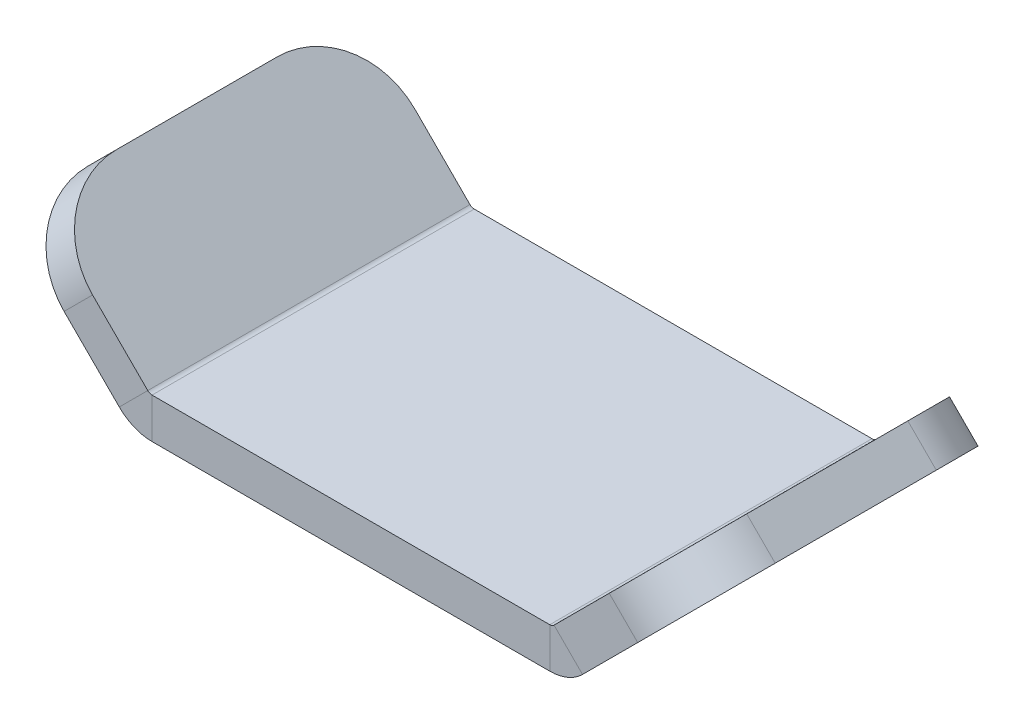
ISO-10303-21;
HEADER;
FILE_DESCRIPTION(('STEP AP214'),'2;1');
FILE_NAME('part.step','',(''),(''),'','','');
FILE_SCHEMA(('AUTOMOTIVE_DESIGN { 1 0 10303 214 1 1 1 1 }'));
ENDSEC;
DATA;
#1=APPLICATION_CONTEXT('core data for automotive mechanical design processes');
#2=APPLICATION_PROTOCOL_DEFINITION('international standard','automotive_design',2000,#1);
#3=PRODUCT_CONTEXT('',#1,'mechanical');
#4=PRODUCT('Part','Part','',(#3));
#5=PRODUCT_RELATED_PRODUCT_CATEGORY('part','',(#4));
#6=PRODUCT_DEFINITION_FORMATION('','',#4);
#7=PRODUCT_DEFINITION_CONTEXT('part definition',#1,'design');
#8=PRODUCT_DEFINITION('design','',#6,#7);
#9=PRODUCT_DEFINITION_SHAPE('','',#8);
#10=(LENGTH_UNIT() NAMED_UNIT(*) SI_UNIT(.MILLI.,.METRE.));
#11=(NAMED_UNIT(*) PLANE_ANGLE_UNIT() SI_UNIT($,.RADIAN.));
#12=(NAMED_UNIT(*) SI_UNIT($,.STERADIAN.) SOLID_ANGLE_UNIT());
#13=UNCERTAINTY_MEASURE_WITH_UNIT(LENGTH_MEASURE(1.E-05),#10,'distance_accuracy_value','');
#14=(GEOMETRIC_REPRESENTATION_CONTEXT(3) GLOBAL_UNCERTAINTY_ASSIGNED_CONTEXT((#13)) GLOBAL_UNIT_ASSIGNED_CONTEXT((#10,
#11,#12)) REPRESENTATION_CONTEXT('',''));
#15=CARTESIAN_POINT('',(0.,0.,0.));
#16=DIRECTION('',(0.,0.,1.));
#17=DIRECTION('',(1.,0.,0.));
#18=AXIS2_PLACEMENT_3D('',#15,#16,#17);
#19=CARTESIAN_POINT('',(25.2196699141101,0.219669914110089,20.));
#20=DIRECTION('',(0.,0.,1.));
#21=DIRECTION('',(1.,0.,0.));
#22=AXIS2_PLACEMENT_3D('',#19,#20,#21);
#23=PLANE('',#22);
#24=DIRECTION('',(0.707106781186549,-0.707106781186546,0.));
#25=VECTOR('',#24,1.);
#26=CARTESIAN_POINT('',(25.2196699141101,0.219669914110089,20.));
#27=LINE('',#26,#25);
#28=CARTESIAN_POINT('',(25.2196699141101,0.219669914110089,20.));
#29=VERTEX_POINT('',#28);
#30=CARTESIAN_POINT('',(28.7552038200428,-3.31586399182264,20.));
#31=VERTEX_POINT('',#30);
#32=EDGE_CURVE('E288',#29,#31,#27,.T.);
#33=ORIENTED_EDGE('',*,*,#32,.F.);
#34=CARTESIAN_POINT('',(24.6893398282202,0.75,20.));
#35=DIRECTION('',(0.,0.,1.));
#36=DIRECTION('',(1.,0.,0.));
#37=AXIS2_PLACEMENT_3D('',#34,#35,#36);
#38=CIRCLE('',#37,0.75);
#39=CARTESIAN_POINT('',(24.6893398282202,0.,20.));
#40=VERTEX_POINT('',#39);
#41=EDGE_CURVE('E253',#29,#40,#38,.F.);
#42=ORIENTED_EDGE('',*,*,#41,.T.);
#43=DIRECTION('',(0.,1.,0.));
#44=VECTOR('',#43,1.);
#45=CARTESIAN_POINT('',(24.6893398282202,-5.,20.));
#46=LINE('',#45,#44);
#47=CARTESIAN_POINT('',(24.6893398282202,-5.,20.));
#48=VERTEX_POINT('',#47);
#49=EDGE_CURVE('E286',#48,#40,#46,.T.);
#50=ORIENTED_EDGE('',*,*,#49,.F.);
#51=CARTESIAN_POINT('',(24.6893398282202,0.75,20.));
#52=DIRECTION('',(0.,0.,1.));
#53=DIRECTION('',(1.,0.,0.));
#54=AXIS2_PLACEMENT_3D('',#51,#52,#53);
#55=CIRCLE('',#54,5.75);
#56=EDGE_CURVE('E246',#31,#48,#55,.F.);
#57=ORIENTED_EDGE('',*,*,#56,.F.);
#58=EDGE_LOOP('',(#33,#42,#50,#57));
#59=FACE_BOUND('',#58,.T.);
#60=ADVANCED_FACE('F38',(#59),#23,.T.);
#61=CARTESIAN_POINT('',(24.6893398282202,-5.,20.));
#62=DIRECTION('',(0.,0.,1.));
#63=DIRECTION('',(1.,0.,0.));
#64=AXIS2_PLACEMENT_3D('',#61,#62,#63);
#65=PLANE('',#64);
#66=DIRECTION('',(-0.707106781186546,-0.707106781186549,0.));
#67=VECTOR('',#66,1.);
#68=CARTESIAN_POINT('',(28.5355339059327,-3.53553390593273,20.));
#69=LINE('',#68,#67);
#70=CARTESIAN_POINT('',(35.6066017177982,3.53553390593275,20.));
#71=VERTEX_POINT('',#70);
#72=EDGE_CURVE('E249',#71,#31,#69,.T.);
#73=ORIENTED_EDGE('',*,*,#72,.F.);
#74=DIRECTION('',(0.707106781186548,-0.707106781186547,0.));
#75=VECTOR('',#74,1.);
#76=CARTESIAN_POINT('',(34.4157377259756,4.7263978977554,20.));
#77=LINE('',#76,#75);
#78=CARTESIAN_POINT('',(32.0710678118655,7.07106781186549,20.));
#79=VERTEX_POINT('',#78);
#80=EDGE_CURVE('E46',#71,#79,#77,.F.);
#81=ORIENTED_EDGE('',*,*,#80,.T.);
#82=DIRECTION('',(-0.707106781186547,-0.707106781186549,0.));
#83=VECTOR('',#82,1.);
#84=CARTESIAN_POINT('',(25.,0.,20.));
#85=LINE('',#84,#83);
#86=EDGE_CURVE('E251',#79,#29,#85,.T.);
#87=ORIENTED_EDGE('',*,*,#86,.T.);
#88=ORIENTED_EDGE('',*,*,#32,.T.);
#89=EDGE_LOOP('',(#73,#81,#87,#88));
#90=FACE_BOUND('',#89,.T.);
#91=ADVANCED_FACE('F338',(#90),#65,.T.);
#92=CARTESIAN_POINT('',(-24.6893398282202,0.,20.));
#93=DIRECTION('',(0.,0.,1.));
#94=DIRECTION('',(1.,0.,0.));
#95=AXIS2_PLACEMENT_3D('',#92,#93,#94);
#96=PLANE('',#95);
#97=DIRECTION('',(0.,-1.,0.));
#98=VECTOR('',#97,1.);
#99=CARTESIAN_POINT('',(-24.6893398282202,0.,20.));
#100=LINE('',#99,#98);
#101=CARTESIAN_POINT('',(-24.6893398282202,0.,20.));
#102=VERTEX_POINT('',#101);
#103=CARTESIAN_POINT('',(-24.6893398282202,-5.,20.));
#104=VERTEX_POINT('',#103);
#105=EDGE_CURVE('E284',#102,#104,#100,.T.);
#106=ORIENTED_EDGE('',*,*,#105,.F.);
#107=CARTESIAN_POINT('',(-24.6893398282202,0.749999999999998,20.));
#108=DIRECTION('',(0.,0.,1.));
#109=DIRECTION('',(1.,0.,0.));
#110=AXIS2_PLACEMENT_3D('',#107,#108,#109);
#111=CIRCLE('',#110,0.75);
#112=CARTESIAN_POINT('',(-25.2196699141101,0.219669914110086,20.));
#113=VERTEX_POINT('',#112);
#114=EDGE_CURVE('E259',#102,#113,#111,.F.);
#115=ORIENTED_EDGE('',*,*,#114,.T.);
#116=DIRECTION('',(0.707106781186548,0.707106781186547,0.));
#117=VECTOR('',#116,1.);
#118=CARTESIAN_POINT('',(-28.7552038200428,-3.31586399182265,20.));
#119=LINE('',#118,#117);
#120=CARTESIAN_POINT('',(-28.7552038200428,-3.31586399182265,20.));
#121=VERTEX_POINT('',#120);
#122=EDGE_CURVE('E282',#121,#113,#119,.T.);
#123=ORIENTED_EDGE('',*,*,#122,.F.);
#124=CARTESIAN_POINT('',(-24.6893398282202,0.749999999999998,20.));
#125=DIRECTION('',(0.,0.,1.));
#126=DIRECTION('',(1.,0.,0.));
#127=AXIS2_PLACEMENT_3D('',#124,#125,#126);
#128=CIRCLE('',#127,5.75);
#129=EDGE_CURVE('E158',#104,#121,#128,.F.);
#130=ORIENTED_EDGE('',*,*,#129,.F.);
#131=EDGE_LOOP('',(#106,#115,#123,#130));
#132=FACE_BOUND('',#131,.T.);
#133=ADVANCED_FACE('F357',(#132),#96,.T.);
#134=CARTESIAN_POINT('',(-28.7552038200428,-3.31586399182265,20.));
#135=DIRECTION('',(0.,0.,1.));
#136=DIRECTION('',(1.,0.,0.));
#137=AXIS2_PLACEMENT_3D('',#134,#135,#136);
#138=PLANE('',#137);
#139=DIRECTION('',(-1.,0.,0.));
#140=VECTOR('',#139,1.);
#141=CARTESIAN_POINT('',(25.,0.,20.));
#142=LINE('',#141,#140);
#143=EDGE_CURVE('E256',#40,#102,#142,.T.);
#144=ORIENTED_EDGE('',*,*,#143,.T.);
#145=ORIENTED_EDGE('',*,*,#105,.T.);
#146=DIRECTION('',(1.,0.,0.));
#147=VECTOR('',#146,1.);
#148=CARTESIAN_POINT('',(25.,-5.,20.));
#149=LINE('',#148,#147);
#150=EDGE_CURVE('E243',#48,#104,#149,.F.);
#151=ORIENTED_EDGE('',*,*,#150,.F.);
#152=ORIENTED_EDGE('',*,*,#49,.T.);
#153=EDGE_LOOP('',(#144,#145,#151,#152));
#154=FACE_BOUND('',#153,.T.);
#155=ADVANCED_FACE('F359',(#154),#138,.T.);
#156=CARTESIAN_POINT('',(-25.,0.,20.));
#157=DIRECTION('',(-0.707106781186549,-0.707106781186547,0.));
#158=DIRECTION('',(0.707106781186546,-0.707106781186549,0.));
#159=AXIS2_PLACEMENT_3D('',#156,#157,#158);
#160=PLANE('',#159);
#161=DIRECTION('',(0.,0.,-1.));
#162=VECTOR('',#161,1.);
#163=CARTESIAN_POINT('',(-39.1421356237309,14.142135623731,20.));
#164=LINE('',#163,#162);
#165=CARTESIAN_POINT('',(-39.1421356237309,14.142135623731,10.));
#166=VERTEX_POINT('',#165);
#167=CARTESIAN_POINT('',(-39.1421356237309,14.142135623731,-10.));
#168=VERTEX_POINT('',#167);
#169=EDGE_CURVE('E280',#166,#168,#164,.T.);
#170=ORIENTED_EDGE('',*,*,#169,.F.);
#171=CARTESIAN_POINT('',(-32.0710678118655,7.07106781186549,10.));
#172=DIRECTION('',(-0.707106781186549,-0.707106781186547,0.));
#173=DIRECTION('',(0.707106781186546,-0.707106781186549,0.));
#174=AXIS2_PLACEMENT_3D('',#171,#172,#173);
#175=CIRCLE('',#174,10.);
#176=CARTESIAN_POINT('',(-32.0710678118655,7.07106781186549,20.));
#177=VERTEX_POINT('',#176);
#178=EDGE_CURVE('E294',#166,#177,#175,.F.);
#179=ORIENTED_EDGE('',*,*,#178,.T.);
#180=DIRECTION('',(-0.707106781186547,0.707106781186549,0.));
#181=VECTOR('',#180,1.);
#182=CARTESIAN_POINT('',(-25.,0.,20.));
#183=LINE('',#182,#181);
#184=EDGE_CURVE('E237',#113,#177,#183,.T.);
#185=ORIENTED_EDGE('',*,*,#184,.F.);
#186=DIRECTION('',(0.,0.,-1.));
#187=VECTOR('',#186,1.);
#188=CARTESIAN_POINT('',(-25.2196699141101,0.219669914110086,20.));
#189=LINE('',#188,#187);
#190=CARTESIAN_POINT('',(-25.2196699141101,0.219669914110086,-20.));
#191=VERTEX_POINT('',#190);
#192=EDGE_CURVE('E262',#113,#191,#189,.T.);
#193=ORIENTED_EDGE('',*,*,#192,.T.);
#194=DIRECTION('',(-0.707106781186547,0.707106781186549,0.));
#195=VECTOR('',#194,1.);
#196=CARTESIAN_POINT('',(-25.,0.,-20.));
#197=LINE('',#196,#195);
#198=CARTESIAN_POINT('',(-32.0710678118655,7.07106781186549,-20.));
#199=VERTEX_POINT('',#198);
#200=EDGE_CURVE('E173',#191,#199,#197,.T.);
#201=ORIENTED_EDGE('',*,*,#200,.T.);
#202=CARTESIAN_POINT('',(-32.0710678118655,7.07106781186549,-10.));
#203=DIRECTION('',(0.707106781186549,0.707106781186547,0.));
#204=DIRECTION('',(0.707106781186546,-0.707106781186549,0.));
#205=AXIS2_PLACEMENT_3D('',#202,#203,#204);
#206=CIRCLE('',#205,10.);
#207=EDGE_CURVE('E220',#168,#199,#206,.F.);
#208=ORIENTED_EDGE('',*,*,#207,.F.);
#209=EDGE_LOOP('',(#170,#179,#185,#193,#201,#208));
#210=FACE_BOUND('',#209,.T.);
#211=ADVANCED_FACE('F361',(#210),#160,.F.);
#212=CARTESIAN_POINT('',(-42.6776695296637,10.6066017177982,20.));
#213=DIRECTION('',(-0.707106781186547,0.707106781186548,0.));
#214=DIRECTION('',(-0.707106781186548,-0.707106781186547,0.));
#215=AXIS2_PLACEMENT_3D('',#212,#213,#214);
#216=PLANE('',#215);
#217=DIRECTION('',(0.,0.,-1.));
#218=VECTOR('',#217,1.);
#219=CARTESIAN_POINT('',(-42.6776695296637,10.6066017177982,20.));
#220=LINE('',#219,#218);
#221=CARTESIAN_POINT('',(-42.6776695296637,10.6066017177982,10.));
#222=VERTEX_POINT('',#221);
#223=CARTESIAN_POINT('',(-42.6776695296637,10.6066017177982,-10.));
#224=VERTEX_POINT('',#223);
#225=EDGE_CURVE('E162',#222,#224,#220,.T.);
#226=ORIENTED_EDGE('',*,*,#225,.F.);
#227=DIRECTION('',(0.707106781186548,0.707106781186547,0.));
#228=VECTOR('',#227,1.);
#229=CARTESIAN_POINT('',(-42.6776695296637,10.6066017177982,10.));
#230=LINE('',#229,#228);
#231=EDGE_CURVE('E291',#222,#166,#230,.T.);
#232=ORIENTED_EDGE('',*,*,#231,.T.);
#233=ORIENTED_EDGE('',*,*,#169,.T.);
#234=DIRECTION('',(0.707106781186548,0.707106781186547,0.));
#235=VECTOR('',#234,1.);
#236=CARTESIAN_POINT('',(-42.6776695296637,10.6066017177982,-10.));
#237=LINE('',#236,#235);
#238=EDGE_CURVE('E217',#224,#168,#237,.T.);
#239=ORIENTED_EDGE('',*,*,#238,.F.);
#240=EDGE_LOOP('',(#226,#232,#233,#239));
#241=FACE_BOUND('',#240,.T.);
#242=ADVANCED_FACE('F367',(#241),#216,.T.);
#243=CARTESIAN_POINT('',(-28.5355339059327,-3.53553390593273,20.));
#244=DIRECTION('',(-0.707106781186549,-0.707106781186546,0.));
#245=DIRECTION('',(0.707106781186546,-0.707106781186549,0.));
#246=AXIS2_PLACEMENT_3D('',#243,#244,#245);
#247=PLANE('',#246);
#248=DIRECTION('',(-0.707106781186546,0.707106781186549,0.));
#249=VECTOR('',#248,1.);
#250=CARTESIAN_POINT('',(-28.5355339059327,-3.53553390593273,20.));
#251=LINE('',#250,#249);
#252=CARTESIAN_POINT('',(-35.6066017177982,3.53553390593275,20.));
#253=VERTEX_POINT('',#252);
#254=EDGE_CURVE('E240',#121,#253,#251,.T.);
#255=ORIENTED_EDGE('',*,*,#254,.T.);
#256=CARTESIAN_POINT('',(-35.6066017177982,3.53553390593275,10.));
#257=DIRECTION('',(-0.707106781186549,-0.707106781186546,0.));
#258=DIRECTION('',(0.707106781186546,-0.707106781186549,0.));
#259=AXIS2_PLACEMENT_3D('',#256,#257,#258);
#260=CIRCLE('',#259,10.);
#261=EDGE_CURVE('E298',#253,#222,#260,.T.);
#262=ORIENTED_EDGE('',*,*,#261,.T.);
#263=ORIENTED_EDGE('',*,*,#225,.T.);
#264=CARTESIAN_POINT('',(-35.6066017177982,3.53553390593275,-10.));
#265=DIRECTION('',(0.707106781186549,0.707106781186546,0.));
#266=DIRECTION('',(0.707106781186546,-0.707106781186549,0.));
#267=AXIS2_PLACEMENT_3D('',#264,#265,#266);
#268=CIRCLE('',#267,10.);
#269=CARTESIAN_POINT('',(-35.6066017177982,3.53553390593275,-20.));
#270=VERTEX_POINT('',#269);
#271=EDGE_CURVE('E171',#270,#224,#268,.T.);
#272=ORIENTED_EDGE('',*,*,#271,.F.);
#273=DIRECTION('',(-0.707106781186546,0.707106781186549,0.));
#274=VECTOR('',#273,1.);
#275=CARTESIAN_POINT('',(-28.5355339059327,-3.53553390593273,-20.));
#276=LINE('',#275,#274);
#277=CARTESIAN_POINT('',(-28.7552038200428,-3.31586399182265,-20.));
#278=VERTEX_POINT('',#277);
#279=EDGE_CURVE('E167',#278,#270,#276,.T.);
#280=ORIENTED_EDGE('',*,*,#279,.F.);
#281=DIRECTION('',(0.,0.,-1.));
#282=VECTOR('',#281,1.);
#283=CARTESIAN_POINT('',(-28.7552038200428,-3.31586399182265,20.));
#284=LINE('',#283,#282);
#285=EDGE_CURVE('E150',#121,#278,#284,.T.);
#286=ORIENTED_EDGE('',*,*,#285,.F.);
#287=EDGE_LOOP('',(#255,#262,#263,#272,#280,#286));
#288=FACE_BOUND('',#287,.T.);
#289=ADVANCED_FACE('F169',(#288),#247,.T.);
#290=CARTESIAN_POINT('',(-24.6893398282202,0.749999999999998,20.));
#291=DIRECTION('',(0.,0.,-1.));
#292=DIRECTION('',(-1.,0.,0.));
#293=AXIS2_PLACEMENT_3D('',#290,#291,#292);
#294=CYLINDRICAL_SURFACE('',#293,5.75);
#295=ORIENTED_EDGE('',*,*,#285,.T.);
#296=CARTESIAN_POINT('',(-24.6893398282202,0.749999999999998,-20.));
#297=DIRECTION('',(0.,0.,1.));
#298=DIRECTION('',(1.,0.,0.));
#299=AXIS2_PLACEMENT_3D('',#296,#297,#298);
#300=CIRCLE('',#299,5.75);
#301=CARTESIAN_POINT('',(-24.6893398282202,-5.,-20.));
#302=VERTEX_POINT('',#301);
#303=EDGE_CURVE('E155',#302,#278,#300,.F.);
#304=ORIENTED_EDGE('',*,*,#303,.F.);
#305=DIRECTION('',(0.,0.,-1.));
#306=VECTOR('',#305,1.);
#307=CARTESIAN_POINT('',(-24.6893398282202,-5.,20.));
#308=LINE('',#307,#306);
#309=EDGE_CURVE('E163',#104,#302,#308,.T.);
#310=ORIENTED_EDGE('',*,*,#309,.F.);
#311=ORIENTED_EDGE('',*,*,#129,.T.);
#312=EDGE_LOOP('',(#295,#304,#310,#311));
#313=FACE_BOUND('',#312,.T.);
#314=ADVANCED_FACE('F152',(#313),#294,.T.);
#315=CARTESIAN_POINT('',(25.,-5.,20.));
#316=DIRECTION('',(0.,-1.,0.));
#317=DIRECTION('',(0.,0.,-1.));
#318=AXIS2_PLACEMENT_3D('',#315,#316,#317);
#319=PLANE('',#318);
#320=ORIENTED_EDGE('',*,*,#309,.T.);
#321=DIRECTION('',(1.,0.,0.));
#322=VECTOR('',#321,1.);
#323=CARTESIAN_POINT('',(25.,-5.,-20.));
#324=LINE('',#323,#322);
#325=CARTESIAN_POINT('',(24.6893398282202,-5.,-20.));
#326=VERTEX_POINT('',#325);
#327=EDGE_CURVE('E188',#326,#302,#324,.F.);
#328=ORIENTED_EDGE('',*,*,#327,.F.);
#329=DIRECTION('',(0.,0.,-1.));
#330=VECTOR('',#329,1.);
#331=CARTESIAN_POINT('',(24.6893398282202,-5.,20.));
#332=LINE('',#331,#330);
#333=EDGE_CURVE('E276',#48,#326,#332,.T.);
#334=ORIENTED_EDGE('',*,*,#333,.F.);
#335=ORIENTED_EDGE('',*,*,#150,.T.);
#336=EDGE_LOOP('',(#320,#328,#334,#335));
#337=FACE_BOUND('',#336,.T.);
#338=ADVANCED_FACE('F344',(#337),#319,.T.);
#339=CARTESIAN_POINT('',(24.6893398282202,0.75,20.));
#340=DIRECTION('',(0.,0.,-1.));
#341=DIRECTION('',(-1.,0.,0.));
#342=AXIS2_PLACEMENT_3D('',#339,#340,#341);
#343=CYLINDRICAL_SURFACE('',#342,5.75);
#344=ORIENTED_EDGE('',*,*,#333,.T.);
#345=CARTESIAN_POINT('',(24.6893398282202,0.75,-20.));
#346=DIRECTION('',(0.,0.,1.));
#347=DIRECTION('',(1.,0.,0.));
#348=AXIS2_PLACEMENT_3D('',#345,#346,#347);
#349=CIRCLE('',#348,5.75);
#350=CARTESIAN_POINT('',(28.7552038200428,-3.31586399182264,-20.));
#351=VERTEX_POINT('',#350);
#352=EDGE_CURVE('E191',#351,#326,#349,.F.);
#353=ORIENTED_EDGE('',*,*,#352,.F.);
#354=DIRECTION('',(0.,0.,-1.));
#355=VECTOR('',#354,1.);
#356=CARTESIAN_POINT('',(28.7552038200428,-3.31586399182264,20.));
#357=LINE('',#356,#355);
#358=EDGE_CURVE('E274',#31,#351,#357,.T.);
#359=ORIENTED_EDGE('',*,*,#358,.F.);
#360=ORIENTED_EDGE('',*,*,#56,.T.);
#361=EDGE_LOOP('',(#344,#353,#359,#360));
#362=FACE_BOUND('',#361,.T.);
#363=ADVANCED_FACE('F340',(#362),#343,.T.);
#364=CARTESIAN_POINT('',(28.5355339059327,-3.53553390593273,20.));
#365=DIRECTION('',(0.707106781186549,-0.707106781186546,0.));
#366=DIRECTION('',(0.707106781186546,0.707106781186549,0.));
#367=AXIS2_PLACEMENT_3D('',#364,#365,#366);
#368=PLANE('',#367);
#369=DIRECTION('',(0.,0.,-1.));
#370=VECTOR('',#369,1.);
#371=CARTESIAN_POINT('',(42.6776695296637,10.6066017177982,20.));
#372=LINE('',#371,#370);
#373=CARTESIAN_POINT('',(42.6776695296637,10.6066017177982,10.));
#374=VERTEX_POINT('',#373);
#375=CARTESIAN_POINT('',(42.6776695296637,10.6066017177982,-10.));
#376=VERTEX_POINT('',#375);
#377=EDGE_CURVE('E272',#374,#376,#372,.T.);
#378=ORIENTED_EDGE('',*,*,#377,.F.);
#379=CARTESIAN_POINT('',(35.6066017177982,3.53553390593275,10.));
#380=DIRECTION('',(0.707106781186549,-0.707106781186546,0.));
#381=DIRECTION('',(0.707106781186546,0.707106781186549,0.));
#382=AXIS2_PLACEMENT_3D('',#379,#380,#381);
#383=CIRCLE('',#382,10.);
#384=EDGE_CURVE('E60',#374,#71,#383,.T.);
#385=ORIENTED_EDGE('',*,*,#384,.T.);
#386=ORIENTED_EDGE('',*,*,#72,.T.);
#387=ORIENTED_EDGE('',*,*,#358,.T.);
#388=DIRECTION('',(-0.707106781186546,-0.707106781186549,0.));
#389=VECTOR('',#388,1.);
#390=CARTESIAN_POINT('',(28.5355339059327,-3.53553390593273,-20.));
#391=LINE('',#390,#389);
#392=CARTESIAN_POINT('',(35.6066017177982,3.53553390593275,-20.));
#393=VERTEX_POINT('',#392);
#394=EDGE_CURVE('E197',#393,#351,#391,.T.);
#395=ORIENTED_EDGE('',*,*,#394,.F.);
#396=CARTESIAN_POINT('',(35.6066017177982,3.53553390593275,-10.));
#397=DIRECTION('',(-0.707106781186549,0.707106781186546,0.));
#398=DIRECTION('',(0.707106781186546,0.707106781186549,0.));
#399=AXIS2_PLACEMENT_3D('',#396,#397,#398);
#400=CIRCLE('',#399,10.);
#401=EDGE_CURVE('E229',#376,#393,#400,.T.);
#402=ORIENTED_EDGE('',*,*,#401,.F.);
#403=EDGE_LOOP('',(#378,#385,#386,#387,#395,#402));
#404=FACE_BOUND('',#403,.T.);
#405=ADVANCED_FACE('F311',(#404),#368,.T.);
#406=CARTESIAN_POINT('',(39.1421356237309,14.142135623731,20.));
#407=DIRECTION('',(0.707106781186547,0.707106781186548,0.));
#408=DIRECTION('',(-0.707106781186548,0.707106781186547,0.));
#409=AXIS2_PLACEMENT_3D('',#406,#407,#408);
#410=PLANE('',#409);
#411=DIRECTION('',(0.,0.,-1.));
#412=VECTOR('',#411,1.);
#413=CARTESIAN_POINT('',(39.1421356237309,14.142135623731,20.));
#414=LINE('',#413,#412);
#415=CARTESIAN_POINT('',(39.1421356237309,14.142135623731,10.));
#416=VERTEX_POINT('',#415);
#417=CARTESIAN_POINT('',(39.1421356237309,14.142135623731,-10.));
#418=VERTEX_POINT('',#417);
#419=EDGE_CURVE('E270',#416,#418,#414,.T.);
#420=ORIENTED_EDGE('',*,*,#419,.F.);
#421=DIRECTION('',(0.707106781186548,-0.707106781186547,0.));
#422=VECTOR('',#421,1.);
#423=CARTESIAN_POINT('',(39.1421356237309,14.142135623731,10.));
#424=LINE('',#423,#422);
#425=EDGE_CURVE('E300',#416,#374,#424,.T.);
#426=ORIENTED_EDGE('',*,*,#425,.T.);
#427=ORIENTED_EDGE('',*,*,#377,.T.);
#428=DIRECTION('',(0.707106781186548,-0.707106781186547,0.));
#429=VECTOR('',#428,1.);
#430=CARTESIAN_POINT('',(39.1421356237309,14.142135623731,-10.));
#431=LINE('',#430,#429);
#432=EDGE_CURVE('E226',#418,#376,#431,.T.);
#433=ORIENTED_EDGE('',*,*,#432,.F.);
#434=EDGE_LOOP('',(#420,#426,#427,#433));
#435=FACE_BOUND('',#434,.T.);
#436=ADVANCED_FACE('F306',(#435),#410,.T.);
#437=CARTESIAN_POINT('',(25.,0.,20.));
#438=DIRECTION('',(0.707106781186549,-0.707106781186547,0.));
#439=DIRECTION('',(0.707106781186546,0.707106781186549,0.));
#440=AXIS2_PLACEMENT_3D('',#437,#438,#439);
#441=PLANE('',#440);
#442=ORIENTED_EDGE('',*,*,#86,.F.);
#443=CARTESIAN_POINT('',(32.0710678118655,7.07106781186549,10.));
#444=DIRECTION('',(0.707106781186549,-0.707106781186547,0.));
#445=DIRECTION('',(0.707106781186546,0.707106781186549,0.));
#446=AXIS2_PLACEMENT_3D('',#443,#444,#445);
#447=CIRCLE('',#446,10.);
#448=EDGE_CURVE('E11',#79,#416,#447,.F.);
#449=ORIENTED_EDGE('',*,*,#448,.T.);
#450=ORIENTED_EDGE('',*,*,#419,.T.);
#451=CARTESIAN_POINT('',(32.0710678118655,7.07106781186549,-10.));
#452=DIRECTION('',(-0.707106781186549,0.707106781186547,0.));
#453=DIRECTION('',(0.707106781186546,0.707106781186549,0.));
#454=AXIS2_PLACEMENT_3D('',#451,#452,#453);
#455=CIRCLE('',#454,10.);
#456=CARTESIAN_POINT('',(32.0710678118655,7.07106781186549,-20.));
#457=VERTEX_POINT('',#456);
#458=EDGE_CURVE('E234',#457,#418,#455,.F.);
#459=ORIENTED_EDGE('',*,*,#458,.F.);
#460=DIRECTION('',(-0.707106781186547,-0.707106781186549,0.));
#461=VECTOR('',#460,1.);
#462=CARTESIAN_POINT('',(25.,0.,-20.));
#463=LINE('',#462,#461);
#464=CARTESIAN_POINT('',(25.2196699141101,0.219669914110089,-20.));
#465=VERTEX_POINT('',#464);
#466=EDGE_CURVE('E200',#457,#465,#463,.T.);
#467=ORIENTED_EDGE('',*,*,#466,.T.);
#468=DIRECTION('',(0.,0.,-1.));
#469=VECTOR('',#468,1.);
#470=CARTESIAN_POINT('',(25.2196699141101,0.219669914110089,20.));
#471=LINE('',#470,#469);
#472=EDGE_CURVE('E268',#29,#465,#471,.T.);
#473=ORIENTED_EDGE('',*,*,#472,.F.);
#474=EDGE_LOOP('',(#442,#449,#450,#459,#467,#473));
#475=FACE_BOUND('',#474,.T.);
#476=ADVANCED_FACE('F324',(#475),#441,.F.);
#477=CARTESIAN_POINT('',(24.6893398282202,0.75,20.));
#478=DIRECTION('',(0.,0.,-1.));
#479=DIRECTION('',(-1.,0.,0.));
#480=AXIS2_PLACEMENT_3D('',#477,#478,#479);
#481=CYLINDRICAL_SURFACE('',#480,0.75);
#482=ORIENTED_EDGE('',*,*,#472,.T.);
#483=CARTESIAN_POINT('',(24.6893398282202,0.75,-20.));
#484=DIRECTION('',(0.,0.,1.));
#485=DIRECTION('',(1.,0.,0.));
#486=AXIS2_PLACEMENT_3D('',#483,#484,#485);
#487=CIRCLE('',#486,0.75);
#488=CARTESIAN_POINT('',(24.6893398282202,0.,-20.));
#489=VERTEX_POINT('',#488);
#490=EDGE_CURVE('E203',#465,#489,#487,.F.);
#491=ORIENTED_EDGE('',*,*,#490,.T.);
#492=DIRECTION('',(0.,0.,-1.));
#493=VECTOR('',#492,1.);
#494=CARTESIAN_POINT('',(24.6893398282202,0.,20.));
#495=LINE('',#494,#493);
#496=EDGE_CURVE('E266',#40,#489,#495,.T.);
#497=ORIENTED_EDGE('',*,*,#496,.F.);
#498=ORIENTED_EDGE('',*,*,#41,.F.);
#499=EDGE_LOOP('',(#482,#491,#497,#498));
#500=FACE_BOUND('',#499,.T.);
#501=ADVANCED_FACE('F331',(#500),#481,.F.);
#502=CARTESIAN_POINT('',(25.,0.,20.));
#503=DIRECTION('',(0.,-1.,0.));
#504=DIRECTION('',(0.,0.,-1.));
#505=AXIS2_PLACEMENT_3D('',#502,#503,#504);
#506=PLANE('',#505);
#507=ORIENTED_EDGE('',*,*,#496,.T.);
#508=DIRECTION('',(-1.,0.,0.));
#509=VECTOR('',#508,1.);
#510=CARTESIAN_POINT('',(25.,0.,-20.));
#511=LINE('',#510,#509);
#512=CARTESIAN_POINT('',(-24.6893398282202,0.,-20.));
#513=VERTEX_POINT('',#512);
#514=EDGE_CURVE('E206',#489,#513,#511,.T.);
#515=ORIENTED_EDGE('',*,*,#514,.T.);
#516=DIRECTION('',(0.,0.,-1.));
#517=VECTOR('',#516,1.);
#518=CARTESIAN_POINT('',(-24.6893398282202,0.,20.));
#519=LINE('',#518,#517);
#520=EDGE_CURVE('E264',#102,#513,#519,.T.);
#521=ORIENTED_EDGE('',*,*,#520,.F.);
#522=ORIENTED_EDGE('',*,*,#143,.F.);
#523=EDGE_LOOP('',(#507,#515,#521,#522));
#524=FACE_BOUND('',#523,.T.);
#525=ADVANCED_FACE('F350',(#524),#506,.F.);
#526=CARTESIAN_POINT('',(-24.6893398282202,0.749999999999998,20.));
#527=DIRECTION('',(0.,0.,-1.));
#528=DIRECTION('',(-1.,0.,0.));
#529=AXIS2_PLACEMENT_3D('',#526,#527,#528);
#530=CYLINDRICAL_SURFACE('',#529,0.75);
#531=ORIENTED_EDGE('',*,*,#520,.T.);
#532=CARTESIAN_POINT('',(-24.6893398282202,0.749999999999998,-20.));
#533=DIRECTION('',(0.,0.,1.));
#534=DIRECTION('',(1.,0.,0.));
#535=AXIS2_PLACEMENT_3D('',#532,#533,#534);
#536=CIRCLE('',#535,0.75);
#537=EDGE_CURVE('E184',#513,#191,#536,.F.);
#538=ORIENTED_EDGE('',*,*,#537,.T.);
#539=ORIENTED_EDGE('',*,*,#192,.F.);
#540=ORIENTED_EDGE('',*,*,#114,.F.);
#541=EDGE_LOOP('',(#531,#538,#539,#540));
#542=FACE_BOUND('',#541,.T.);
#543=ADVANCED_FACE('F354',(#542),#530,.F.);
#544=CARTESIAN_POINT('',(-24.6893398282202,0.749999999999998,20.));
#545=DIRECTION('',(0.,0.,1.));
#546=DIRECTION('',(1.,0.,0.));
#547=AXIS2_PLACEMENT_3D('',#544,#545,#546);
#548=PLANE('',#547);
#549=ORIENTED_EDGE('',*,*,#184,.T.);
#550=DIRECTION('',(0.707106781186548,0.707106781186547,0.));
#551=VECTOR('',#550,1.);
#552=CARTESIAN_POINT('',(-31.5407377259756,7.60139789775539,20.));
#553=LINE('',#552,#551);
#554=EDGE_CURVE('E296',#177,#253,#553,.F.);
#555=ORIENTED_EDGE('',*,*,#554,.T.);
#556=ORIENTED_EDGE('',*,*,#254,.F.);
#557=ORIENTED_EDGE('',*,*,#122,.T.);
#558=EDGE_LOOP('',(#549,#555,#556,#557));
#559=FACE_BOUND('',#558,.T.);
#560=ADVANCED_FACE('F379',(#559),#548,.T.);
#561=CARTESIAN_POINT('',(-35.6066017177982,3.53553390593276,10.));
#562=DIRECTION('',(0.707106781186548,0.707106781186547,0.));
#563=DIRECTION('',(-0.707106781186547,0.707106781186548,0.));
#564=AXIS2_PLACEMENT_3D('',#561,#562,#563);
#565=CYLINDRICAL_SURFACE('',#564,10.);
#566=ORIENTED_EDGE('',*,*,#261,.F.);
#567=ORIENTED_EDGE('',*,*,#554,.F.);
#568=ORIENTED_EDGE('',*,*,#178,.F.);
#569=ORIENTED_EDGE('',*,*,#231,.F.);
#570=EDGE_LOOP('',(#566,#567,#568,#569));
#571=FACE_BOUND('',#570,.T.);
#572=ADVANCED_FACE('F377',(#571),#565,.T.);
#573=CARTESIAN_POINT('',(32.0710678118655,7.07106781186549,10.));
#574=DIRECTION('',(0.707106781186548,-0.707106781186547,0.));
#575=DIRECTION('',(0.707106781186547,0.707106781186548,0.));
#576=AXIS2_PLACEMENT_3D('',#573,#574,#575);
#577=CYLINDRICAL_SURFACE('',#576,10.);
#578=ORIENTED_EDGE('',*,*,#448,.F.);
#579=ORIENTED_EDGE('',*,*,#80,.F.);
#580=ORIENTED_EDGE('',*,*,#384,.F.);
#581=ORIENTED_EDGE('',*,*,#425,.F.);
#582=EDGE_LOOP('',(#578,#579,#580,#581));
#583=FACE_BOUND('',#582,.T.);
#584=ADVANCED_FACE('F40',(#583),#577,.T.);
#585=CARTESIAN_POINT('',(25.2196699141101,0.219669914110089,-20.));
#586=DIRECTION('',(0.,0.,-1.));
#587=DIRECTION('',(1.,0.,0.));
#588=AXIS2_PLACEMENT_3D('',#585,#586,#587);
#589=PLANE('',#588);
#590=DIRECTION('',(0.707106781186549,-0.707106781186546,0.));
#591=VECTOR('',#590,1.);
#592=CARTESIAN_POINT('',(25.2196699141101,0.219669914110089,-20.));
#593=LINE('',#592,#591);
#594=EDGE_CURVE('E214',#465,#351,#593,.T.);
#595=ORIENTED_EDGE('',*,*,#594,.T.);
#596=ORIENTED_EDGE('',*,*,#352,.T.);
#597=DIRECTION('',(0.,1.,0.));
#598=VECTOR('',#597,1.);
#599=CARTESIAN_POINT('',(24.6893398282202,-5.,-20.));
#600=LINE('',#599,#598);
#601=EDGE_CURVE('E211',#326,#489,#600,.T.);
#602=ORIENTED_EDGE('',*,*,#601,.T.);
#603=ORIENTED_EDGE('',*,*,#490,.F.);
#604=EDGE_LOOP('',(#595,#596,#602,#603));
#605=FACE_BOUND('',#604,.T.);
#606=ADVANCED_FACE('F327',(#605),#589,.T.);
#607=CARTESIAN_POINT('',(24.6893398282202,-5.,-20.));
#608=DIRECTION('',(0.,0.,-1.));
#609=DIRECTION('',(1.,0.,0.));
#610=AXIS2_PLACEMENT_3D('',#607,#608,#609);
#611=PLANE('',#610);
#612=ORIENTED_EDGE('',*,*,#394,.T.);
#613=ORIENTED_EDGE('',*,*,#594,.F.);
#614=ORIENTED_EDGE('',*,*,#466,.F.);
#615=DIRECTION('',(0.707106781186548,-0.707106781186547,0.));
#616=VECTOR('',#615,1.);
#617=CARTESIAN_POINT('',(34.4157377259756,4.7263978977554,-20.));
#618=LINE('',#617,#616);
#619=EDGE_CURVE('E231',#393,#457,#618,.F.);
#620=ORIENTED_EDGE('',*,*,#619,.F.);
#621=EDGE_LOOP('',(#612,#613,#614,#620));
#622=FACE_BOUND('',#621,.T.);
#623=ADVANCED_FACE('F318',(#622),#611,.T.);
#624=CARTESIAN_POINT('',(-24.6893398282202,0.,-20.));
#625=DIRECTION('',(0.,0.,-1.));
#626=DIRECTION('',(1.,0.,0.));
#627=AXIS2_PLACEMENT_3D('',#624,#625,#626);
#628=PLANE('',#627);
#629=DIRECTION('',(0.,-1.,0.));
#630=VECTOR('',#629,1.);
#631=CARTESIAN_POINT('',(-24.6893398282202,0.,-20.));
#632=LINE('',#631,#630);
#633=EDGE_CURVE('E183',#513,#302,#632,.T.);
#634=ORIENTED_EDGE('',*,*,#633,.T.);
#635=ORIENTED_EDGE('',*,*,#303,.T.);
#636=DIRECTION('',(0.707106781186548,0.707106781186547,0.));
#637=VECTOR('',#636,1.);
#638=CARTESIAN_POINT('',(-28.7552038200428,-3.31586399182265,-20.));
#639=LINE('',#638,#637);
#640=EDGE_CURVE('E177',#278,#191,#639,.T.);
#641=ORIENTED_EDGE('',*,*,#640,.T.);
#642=ORIENTED_EDGE('',*,*,#537,.F.);
#643=EDGE_LOOP('',(#634,#635,#641,#642));
#644=FACE_BOUND('',#643,.T.);
#645=ADVANCED_FACE('F186',(#644),#628,.T.);
#646=CARTESIAN_POINT('',(-28.7552038200428,-3.31586399182265,-20.));
#647=DIRECTION('',(0.,0.,-1.));
#648=DIRECTION('',(1.,0.,0.));
#649=AXIS2_PLACEMENT_3D('',#646,#647,#648);
#650=PLANE('',#649);
#651=ORIENTED_EDGE('',*,*,#514,.F.);
#652=ORIENTED_EDGE('',*,*,#601,.F.);
#653=ORIENTED_EDGE('',*,*,#327,.T.);
#654=ORIENTED_EDGE('',*,*,#633,.F.);
#655=EDGE_LOOP('',(#651,#652,#653,#654));
#656=FACE_BOUND('',#655,.T.);
#657=ADVANCED_FACE('F347',(#656),#650,.T.);
#658=CARTESIAN_POINT('',(-24.6893398282202,0.749999999999998,-20.));
#659=DIRECTION('',(0.,0.,-1.));
#660=DIRECTION('',(1.,0.,0.));
#661=AXIS2_PLACEMENT_3D('',#658,#659,#660);
#662=PLANE('',#661);
#663=ORIENTED_EDGE('',*,*,#200,.F.);
#664=ORIENTED_EDGE('',*,*,#640,.F.);
#665=ORIENTED_EDGE('',*,*,#279,.T.);
#666=DIRECTION('',(0.707106781186548,0.707106781186547,0.));
#667=VECTOR('',#666,1.);
#668=CARTESIAN_POINT('',(-31.5407377259756,7.60139789775539,-20.));
#669=LINE('',#668,#667);
#670=EDGE_CURVE('E223',#199,#270,#669,.F.);
#671=ORIENTED_EDGE('',*,*,#670,.F.);
#672=EDGE_LOOP('',(#663,#664,#665,#671));
#673=FACE_BOUND('',#672,.T.);
#674=ADVANCED_FACE('F178',(#673),#662,.T.);
#675=CARTESIAN_POINT('',(-35.6066017177982,3.53553390593276,-10.));
#676=DIRECTION('',(0.707106781186548,0.707106781186547,0.));
#677=DIRECTION('',(-0.707106781186547,0.707106781186548,0.));
#678=AXIS2_PLACEMENT_3D('',#675,#676,#677);
#679=CYLINDRICAL_SURFACE('',#678,10.);
#680=ORIENTED_EDGE('',*,*,#271,.T.);
#681=ORIENTED_EDGE('',*,*,#238,.T.);
#682=ORIENTED_EDGE('',*,*,#207,.T.);
#683=ORIENTED_EDGE('',*,*,#670,.T.);
#684=EDGE_LOOP('',(#680,#681,#682,#683));
#685=FACE_BOUND('',#684,.T.);
#686=ADVANCED_FACE('F396',(#685),#679,.T.);
#687=CARTESIAN_POINT('',(32.0710678118655,7.07106781186549,-10.));
#688=DIRECTION('',(0.707106781186548,-0.707106781186547,0.));
#689=DIRECTION('',(0.707106781186547,0.707106781186548,0.));
#690=AXIS2_PLACEMENT_3D('',#687,#688,#689);
#691=CYLINDRICAL_SURFACE('',#690,10.);
#692=ORIENTED_EDGE('',*,*,#458,.T.);
#693=ORIENTED_EDGE('',*,*,#432,.T.);
#694=ORIENTED_EDGE('',*,*,#401,.T.);
#695=ORIENTED_EDGE('',*,*,#619,.T.);
#696=EDGE_LOOP('',(#692,#693,#694,#695));
#697=FACE_BOUND('',#696,.T.);
#698=ADVANCED_FACE('F315',(#697),#691,.T.);
#699=CLOSED_SHELL('',(#60,#91,#133,#155,#211,#242,#289,#314,#338,#363,#405,#436,#476,#501,#525,
#543,#560,#572,#584,#606,#623,#645,#657,#674,#686,#698));
#700=MANIFOLD_SOLID_BREP('B2',#699);
#701=ADVANCED_BREP_SHAPE_REPRESENTATION('',(#18,#700),#14);
#702=SHAPE_DEFINITION_REPRESENTATION(#9,#701);
ENDSEC;
END-ISO-10303-21;
